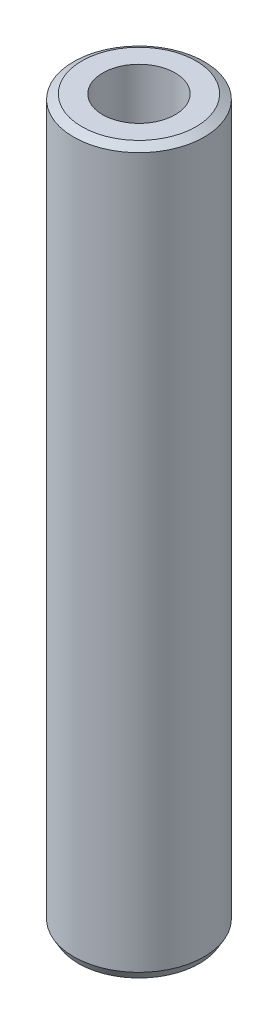
ISO-10303-21;
HEADER;
FILE_DESCRIPTION(('STEP AP214'),'2;1');
FILE_NAME('part.step','',(''),(''),'','','');
FILE_SCHEMA(('AUTOMOTIVE_DESIGN { 1 0 10303 214 1 1 1 1 }'));
ENDSEC;
DATA;
#1=APPLICATION_CONTEXT('core data for automotive mechanical design processes');
#2=APPLICATION_PROTOCOL_DEFINITION('international standard','automotive_design',2000,#1);
#3=PRODUCT_CONTEXT('',#1,'mechanical');
#4=PRODUCT('Part','Part','',(#3));
#5=PRODUCT_RELATED_PRODUCT_CATEGORY('part','',(#4));
#6=PRODUCT_DEFINITION_FORMATION('','',#4);
#7=PRODUCT_DEFINITION_CONTEXT('part definition',#1,'design');
#8=PRODUCT_DEFINITION('design','',#6,#7);
#9=PRODUCT_DEFINITION_SHAPE('','',#8);
#10=(LENGTH_UNIT() NAMED_UNIT(*) SI_UNIT(.MILLI.,.METRE.));
#11=(NAMED_UNIT(*) PLANE_ANGLE_UNIT() SI_UNIT($,.RADIAN.));
#12=(NAMED_UNIT(*) SI_UNIT($,.STERADIAN.) SOLID_ANGLE_UNIT());
#13=UNCERTAINTY_MEASURE_WITH_UNIT(LENGTH_MEASURE(1.E-05),#10,'distance_accuracy_value','');
#14=(GEOMETRIC_REPRESENTATION_CONTEXT(3) GLOBAL_UNCERTAINTY_ASSIGNED_CONTEXT((#13)) GLOBAL_UNIT_ASSIGNED_CONTEXT((#10,
#11,#12)) REPRESENTATION_CONTEXT('',''));
#15=CARTESIAN_POINT('',(0.,0.,0.));
#16=DIRECTION('',(0.,0.,1.));
#17=DIRECTION('',(1.,0.,0.));
#18=AXIS2_PLACEMENT_3D('',#15,#16,#17);
#19=CARTESIAN_POINT('',(0.,82.9639895674765,0.));
#20=DIRECTION('',(0.,-1.,0.));
#21=DIRECTION('',(0.,0.,-1.));
#22=AXIS2_PLACEMENT_3D('',#19,#20,#21);
#23=CYLINDRICAL_SURFACE('',#22,7.5);
#24=CARTESIAN_POINT('',(0.,82.4143224714603,0.));
#25=DIRECTION('',(0.,1.,0.));
#26=DIRECTION('',(0.,0.,1.));
#27=AXIS2_PLACEMENT_3D('',#24,#25,#26);
#28=CIRCLE('',#27,7.5);
#29=CARTESIAN_POINT('',(0.,82.4143224714603,7.5));
#30=VERTEX_POINT('',#29);
#31=EDGE_CURVE('E50',#30,#30,#28,.F.);
#32=ORIENTED_EDGE('',*,*,#31,.T.);
#33=EDGE_LOOP('',(#32));
#34=FACE_BOUND('',#33,.T.);
#35=CARTESIAN_POINT('',(0.,0.952051337548721,0.));
#36=DIRECTION('',(0.,1.,0.));
#37=DIRECTION('',(0.,0.,1.));
#38=AXIS2_PLACEMENT_3D('',#35,#36,#37);
#39=CIRCLE('',#38,7.5);
#40=CARTESIAN_POINT('',(0.,0.952051337548721,7.5));
#41=VERTEX_POINT('',#40);
#42=EDGE_CURVE('E51',#41,#41,#39,.T.);
#43=ORIENTED_EDGE('',*,*,#42,.T.);
#44=EDGE_LOOP('',(#43));
#45=FACE_BOUND('',#44,.T.);
#46=ADVANCED_FACE('F39',(#34,#45),#23,.T.);
#47=CARTESIAN_POINT('',(0.,82.9639895674765,0.));
#48=DIRECTION('',(0.,1.,0.));
#49=DIRECTION('',(0.,0.,1.));
#50=AXIS2_PLACEMENT_3D('',#47,#48,#49);
#51=PLANE('',#50);
#52=CARTESIAN_POINT('',(0.,82.9639895674765,0.));
#53=DIRECTION('',(0.,1.,0.));
#54=DIRECTION('',(0.,0.,1.));
#55=AXIS2_PLACEMENT_3D('',#52,#53,#54);
#56=CIRCLE('',#55,6.54794866245124);
#57=CARTESIAN_POINT('',(0.,82.9639895674765,6.54794866245124));
#58=VERTEX_POINT('',#57);
#59=EDGE_CURVE('E54',#58,#58,#56,.T.);
#60=ORIENTED_EDGE('',*,*,#59,.T.);
#61=EDGE_LOOP('',(#60));
#62=FACE_BOUND('',#61,.T.);
#63=CARTESIAN_POINT('',(0.,82.9639895674765,0.));
#64=DIRECTION('',(0.,1.,0.));
#65=DIRECTION('',(0.,0.,1.));
#66=AXIS2_PLACEMENT_3D('',#63,#64,#65);
#67=CIRCLE('',#66,4.15801363194462);
#68=CARTESIAN_POINT('',(0.,82.9639895674765,4.15801363194462));
#69=VERTEX_POINT('',#68);
#70=EDGE_CURVE('E58',#69,#69,#67,.T.);
#71=ORIENTED_EDGE('',*,*,#70,.F.);
#72=EDGE_LOOP('',(#71));
#73=FACE_BOUND('',#72,.T.);
#74=ADVANCED_FACE('F69',(#62,#73),#51,.T.);
#75=CARTESIAN_POINT('',(0.,0.,0.));
#76=DIRECTION('',(0.,1.,0.));
#77=DIRECTION('',(0.,0.,1.));
#78=AXIS2_PLACEMENT_3D('',#75,#76,#77);
#79=PLANE('',#78);
#80=CARTESIAN_POINT('',(0.,0.,0.));
#81=DIRECTION('',(0.,1.,0.));
#82=DIRECTION('',(0.,0.,1.));
#83=AXIS2_PLACEMENT_3D('',#80,#81,#82);
#84=CIRCLE('',#83,6.95033290398389);
#85=CARTESIAN_POINT('',(0.,0.,6.95033290398389));
#86=VERTEX_POINT('',#85);
#87=EDGE_CURVE('E10',#86,#86,#84,.F.);
#88=ORIENTED_EDGE('',*,*,#87,.T.);
#89=EDGE_LOOP('',(#88));
#90=FACE_BOUND('',#89,.T.);
#91=CARTESIAN_POINT('',(0.,0.,0.));
#92=DIRECTION('',(0.,1.,0.));
#93=DIRECTION('',(0.,0.,1.));
#94=AXIS2_PLACEMENT_3D('',#91,#92,#93);
#95=CIRCLE('',#94,4.15801363194462);
#96=CARTESIAN_POINT('',(0.,0.,4.15801363194462));
#97=VERTEX_POINT('',#96);
#98=EDGE_CURVE('E63',#97,#97,#95,.T.);
#99=ORIENTED_EDGE('',*,*,#98,.T.);
#100=EDGE_LOOP('',(#99));
#101=FACE_BOUND('',#100,.T.);
#102=ADVANCED_FACE('F75',(#90,#101),#79,.F.);
#103=CARTESIAN_POINT('',(0.,82.9639895674765,0.));
#104=DIRECTION('',(0.,-1.,0.));
#105=DIRECTION('',(0.,0.,-1.));
#106=AXIS2_PLACEMENT_3D('',#103,#104,#105);
#107=CYLINDRICAL_SURFACE('',#106,4.15801363194462);
#108=ORIENTED_EDGE('',*,*,#70,.T.);
#109=EDGE_LOOP('',(#108));
#110=FACE_BOUND('',#109,.T.);
#111=ORIENTED_EDGE('',*,*,#98,.F.);
#112=EDGE_LOOP('',(#111));
#113=FACE_BOUND('',#112,.T.);
#114=ADVANCED_FACE('F70',(#110,#113),#107,.F.);
#115=CARTESIAN_POINT('',(0.,82.9639895674765,0.));
#116=DIRECTION('',(0.,-1.,0.));
#117=DIRECTION('',(0.,0.,-1.));
#118=AXIS2_PLACEMENT_3D('',#115,#116,#117);
#119=CONICAL_SURFACE('',#118,6.54794866245124,1.0471975511966);
#120=ORIENTED_EDGE('',*,*,#31,.F.);
#121=EDGE_LOOP('',(#120));
#122=FACE_BOUND('',#121,.T.);
#123=ORIENTED_EDGE('',*,*,#59,.F.);
#124=EDGE_LOOP('',(#123));
#125=FACE_BOUND('',#124,.T.);
#126=ADVANCED_FACE('F81',(#122,#125),#119,.T.);
#127=CARTESIAN_POINT('',(0.,0.952051337548721,0.));
#128=DIRECTION('',(0.,1.,0.));
#129=DIRECTION('',(0.,0.,1.));
#130=AXIS2_PLACEMENT_3D('',#127,#128,#129);
#131=CONICAL_SURFACE('',#130,7.5,0.523598775598308);
#132=CARTESIAN_POINT('',(0.,0.,6.95033290398389));
#133=CARTESIAN_POINT('',(0.,0.00991720143279887,6.95605860290073));
#134=CARTESIAN_POINT('',(0.,0.0198344028655981,6.96178430181756));
#135=CARTESIAN_POINT('',(0.,0.0396688057311966,6.97323569965123));
#136=CARTESIAN_POINT('',(0.,0.0495860071639958,6.97896139856806));
#137=CARTESIAN_POINT('',(0.,0.0694204100295942,6.99041279640173));
#138=CARTESIAN_POINT('',(0.,0.0793376114623933,6.99613849531857));
#139=CARTESIAN_POINT('',(0.,0.0991720143279916,7.00758989315224));
#140=CARTESIAN_POINT('',(0.,0.109089215760791,7.01331559206907));
#141=CARTESIAN_POINT('',(0.,0.128923618626389,7.02476698990274));
#142=CARTESIAN_POINT('',(0.,0.138840820059188,7.03049268881957));
#143=CARTESIAN_POINT('',(0.,0.158675222924787,7.04194408665324));
#144=CARTESIAN_POINT('',(0.,0.168592424357586,7.04766978557008));
#145=CARTESIAN_POINT('',(0.,0.188426827223184,7.05912118340375));
#146=CARTESIAN_POINT('',(0.,0.198344028655983,7.06484688232058));
#147=CARTESIAN_POINT('',(0.,0.218178431521582,7.07629828015425));
#148=CARTESIAN_POINT('',(0.,0.228095632954381,7.08202397907108));
#149=CARTESIAN_POINT('',(0.,0.247930035819979,7.09347537690475));
#150=CARTESIAN_POINT('',(0.,0.257847237252778,7.09920107582159));
#151=CARTESIAN_POINT('',(0.,0.277681640118377,7.11065247365526));
#152=CARTESIAN_POINT('',(0.,0.287598841551176,7.11637817257209));
#153=CARTESIAN_POINT('',(0.,0.307433244416774,7.12782957040576));
#154=CARTESIAN_POINT('',(0.,0.317350445849573,7.13355526932259));
#155=CARTESIAN_POINT('',(0.,0.337184848715172,7.14500666715626));
#156=CARTESIAN_POINT('',(0.,0.347102050147971,7.1507323660731));
#157=CARTESIAN_POINT('',(0.,0.366936453013569,7.16218376390677));
#158=CARTESIAN_POINT('',(0.,0.376853654446368,7.1679094628236));
#159=CARTESIAN_POINT('',(0.,0.396688057311967,7.17936086065727));
#160=CARTESIAN_POINT('',(0.,0.406605258744766,7.1850865595741));
#161=CARTESIAN_POINT('',(0.,0.426439661610364,7.19653795740777));
#162=CARTESIAN_POINT('',(0.,0.436356863043164,7.20226365632461));
#163=CARTESIAN_POINT('',(0.,0.456191265908762,7.21371505415828));
#164=CARTESIAN_POINT('',(0.,0.466108467341561,7.21944075307511));
#165=CARTESIAN_POINT('',(0.,0.485942870207159,7.23089215090878));
#166=CARTESIAN_POINT('',(0.,0.495860071639958,7.23661784982561));
#167=CARTESIAN_POINT('',(0.,0.515694474505557,7.24806924765928));
#168=CARTESIAN_POINT('',(0.,0.525611675938356,7.25379494657612));
#169=CARTESIAN_POINT('',(0.,0.545446078803955,7.26524634440979));
#170=CARTESIAN_POINT('',(0.,0.555363280236754,7.27097204332662));
#171=CARTESIAN_POINT('',(0.,0.575197683102352,7.28242344116029));
#172=CARTESIAN_POINT('',(0.,0.585114884535151,7.28814914007712));
#173=CARTESIAN_POINT('',(0.,0.604949287400749,7.29960053791079));
#174=CARTESIAN_POINT('',(0.,0.614866488833549,7.30532623682763));
#175=CARTESIAN_POINT('',(0.,0.634700891699147,7.3167776346613));
#176=CARTESIAN_POINT('',(0.,0.644618093131946,7.32250333357813));
#177=CARTESIAN_POINT('',(0.,0.664452495997545,7.3339547314118));
#178=CARTESIAN_POINT('',(0.,0.674369697430344,7.33968043032863));
#179=CARTESIAN_POINT('',(0.,0.694204100295942,7.3511318281623));
#180=CARTESIAN_POINT('',(0.,0.704121301728741,7.35685752707914));
#181=CARTESIAN_POINT('',(0.,0.72395570459434,7.36830892491281));
#182=CARTESIAN_POINT('',(0.,0.733872906027139,7.37403462382964));
#183=CARTESIAN_POINT('',(0.,0.753707308892737,7.38548602166331));
#184=CARTESIAN_POINT('',(0.,0.763624510325536,7.39121172058015));
#185=CARTESIAN_POINT('',(0.,0.783458913191135,7.40266311841381));
#186=CARTESIAN_POINT('',(0.,0.793376114623934,7.40838881733065));
#187=CARTESIAN_POINT('',(0.,0.813210517489532,7.41984021516432));
#188=CARTESIAN_POINT('',(0.,0.823127718922331,7.42556591408115));
#189=CARTESIAN_POINT('',(0.,0.84296212178793,7.43701731191482));
#190=CARTESIAN_POINT('',(0.,0.852879323220729,7.44274301083166));
#191=CARTESIAN_POINT('',(0.,0.872713726086327,7.45419440866532));
#192=CARTESIAN_POINT('',(0.,0.882630927519126,7.45992010758216));
#193=CARTESIAN_POINT('',(0.,0.902465330384725,7.47137150541583));
#194=CARTESIAN_POINT('',(0.,0.912382531817524,7.47709720433266));
#195=CARTESIAN_POINT('',(0.,0.932216934683122,7.48854860216633));
#196=CARTESIAN_POINT('',(0.,0.942134136115921,7.49427430108317));
#197=CARTESIAN_POINT('',(0.,0.952051337548721,7.5));
#198=B_SPLINE_CURVE_WITH_KNOTS('',3,(#132,#133,#134,#135,#136,#137,#138,#139,#140,#141,#142,
#143,#144,#145,#146,#147,#148,#149,#150,#151,#152,#153,#154,#155,#156,#157,#158,#159,#160,#161,
#162,#163,#164,#165,#166,#167,#168,#169,#170,#171,#172,#173,#174,#175,#176,#177,#178,#179,#180,
#181,#182,#183,#184,#185,#186,#187,#188,#189,#190,#191,#192,#193,#194,#195,#196,#197),
.UNSPECIFIED.,.F.,.F.,(4,2,2,2,2,2,2,2,2,2,2,2,2,2,2,2,2,2,2,2,2,2,2,2,2,2,2,2,2,2,2,2,4),(0.,
0.0343541935010064,0.0687083870020123,0.103062580503019,0.137416774004025,0.171770967505031,
0.206125161006037,0.240479354507044,0.27483354800805,0.309187741509056,0.343541935010062,
0.377896128511069,0.412250322012075,0.446604515513081,0.480958709014087,0.515312902515094,
0.5496670960161,0.584021289517106,0.618375483018112,0.652729676519119,0.687083870020125,
0.721438063521131,0.755792257022137,0.790146450523144,0.82450064402415,0.858854837525156,
0.893209031026163,0.927563224527169,0.961917418028175,0.996271611529181,1.03062580503019,
1.06497999853119,1.0993341920322),.UNSPECIFIED.);
#199=EDGE_CURVE('BSEAM45',#86,#41,#198,.T.);
#200=ORIENTED_EDGE('',*,*,#87,.F.);
#201=ORIENTED_EDGE('',*,*,#42,.F.);
#202=ORIENTED_EDGE('',*,*,#199,.T.);
#203=ORIENTED_EDGE('',*,*,#199,.F.);
#204=EDGE_LOOP('',(#200,#202,#201,#203));
#205=FACE_BOUND('',#204,.T.);
#206=ADVANCED_FACE('F45',(#205),#131,.T.);
#207=CLOSED_SHELL('',(#46,#74,#102,#114,#126,#206));
#208=MANIFOLD_SOLID_BREP('B2',#207);
#209=ADVANCED_BREP_SHAPE_REPRESENTATION('',(#18,#208),#14);
#210=SHAPE_DEFINITION_REPRESENTATION(#9,#209);
ENDSEC;
END-ISO-10303-21;
